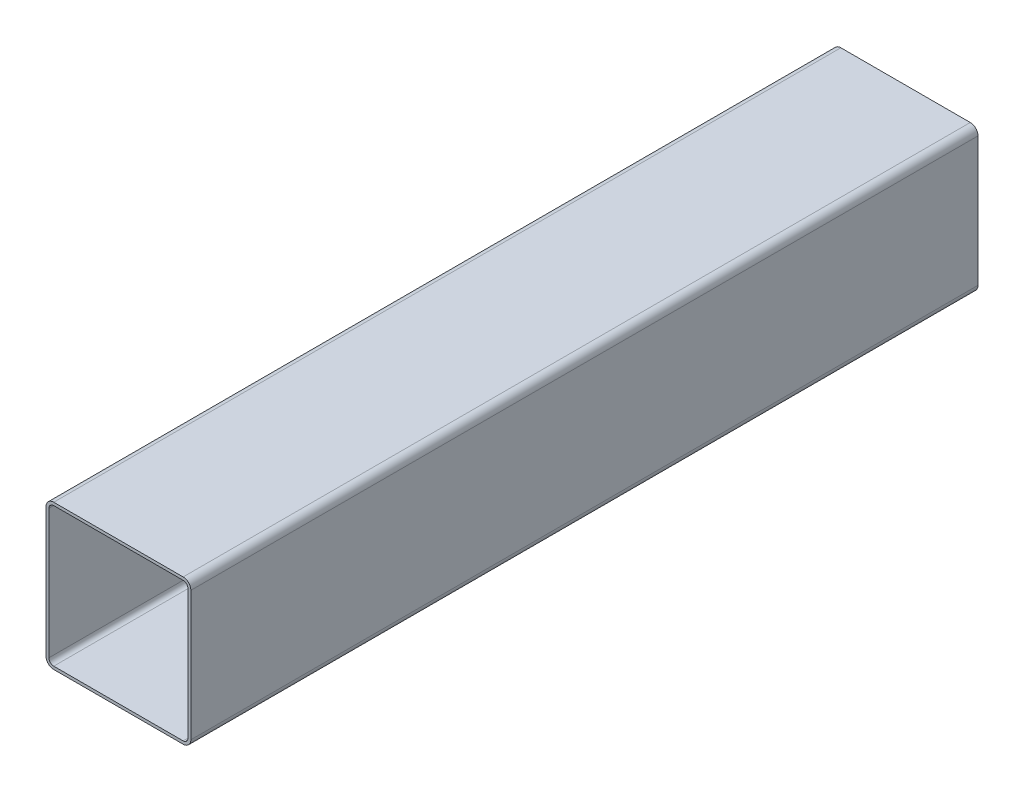
ISO-10303-21;
HEADER;
FILE_DESCRIPTION(('STEP AP214'),'2;1');
FILE_NAME('part.step','',(''),(''),'','','');
FILE_SCHEMA(('AUTOMOTIVE_DESIGN { 1 0 10303 214 1 1 1 1 }'));
ENDSEC;
DATA;
#1=APPLICATION_CONTEXT('core data for automotive mechanical design processes');
#2=APPLICATION_PROTOCOL_DEFINITION('international standard','automotive_design',2000,#1);
#3=PRODUCT_CONTEXT('',#1,'mechanical');
#4=PRODUCT('Part','Part','',(#3));
#5=PRODUCT_RELATED_PRODUCT_CATEGORY('part','',(#4));
#6=PRODUCT_DEFINITION_FORMATION('','',#4);
#7=PRODUCT_DEFINITION_CONTEXT('part definition',#1,'design');
#8=PRODUCT_DEFINITION('design','',#6,#7);
#9=PRODUCT_DEFINITION_SHAPE('','',#8);
#10=(LENGTH_UNIT() NAMED_UNIT(*) SI_UNIT(.MILLI.,.METRE.));
#11=(NAMED_UNIT(*) PLANE_ANGLE_UNIT() SI_UNIT($,.RADIAN.));
#12=(NAMED_UNIT(*) SI_UNIT($,.STERADIAN.) SOLID_ANGLE_UNIT());
#13=UNCERTAINTY_MEASURE_WITH_UNIT(LENGTH_MEASURE(1.E-05),#10,'distance_accuracy_value','');
#14=(GEOMETRIC_REPRESENTATION_CONTEXT(3) GLOBAL_UNCERTAINTY_ASSIGNED_CONTEXT((#13)) GLOBAL_UNIT_ASSIGNED_CONTEXT((#10,
#11,#12)) REPRESENTATION_CONTEXT('',''));
#15=CARTESIAN_POINT('',(0.,0.,0.));
#16=DIRECTION('',(0.,0.,1.));
#17=DIRECTION('',(1.,0.,0.));
#18=AXIS2_PLACEMENT_3D('',#15,#16,#17);
#19=CARTESIAN_POINT('',(-67.,-67.,815.));
#20=DIRECTION('',(0.,0.,1.));
#21=DIRECTION('',(1.,0.,0.));
#22=AXIS2_PLACEMENT_3D('',#19,#20,#21);
#23=PLANE('',#22);
#24=CARTESIAN_POINT('',(-67.,-67.,815.));
#25=DIRECTION('',(0.,0.,1.));
#26=DIRECTION('',(1.,0.,0.));
#27=AXIS2_PLACEMENT_3D('',#24,#25,#26);
#28=CIRCLE('',#27,7.99999999999999);
#29=CARTESIAN_POINT('',(-75.,-66.9999999999999,815.));
#30=VERTEX_POINT('',#29);
#31=CARTESIAN_POINT('',(-66.9999999999999,-75.,815.));
#32=VERTEX_POINT('',#31);
#33=EDGE_CURVE('E263',#30,#32,#28,.T.);
#34=ORIENTED_EDGE('',*,*,#33,.T.);
#35=DIRECTION('',(1.,0.,0.));
#36=VECTOR('',#35,1.);
#37=CARTESIAN_POINT('',(66.9999999999999,-75.,815.));
#38=LINE('',#37,#36);
#39=CARTESIAN_POINT('',(66.9999999999999,-75.,815.));
#40=VERTEX_POINT('',#39);
#41=EDGE_CURVE('E266',#32,#40,#38,.T.);
#42=ORIENTED_EDGE('',*,*,#41,.T.);
#43=CARTESIAN_POINT('',(67.,-67.,815.));
#44=DIRECTION('',(0.,0.,1.));
#45=DIRECTION('',(1.,0.,0.));
#46=AXIS2_PLACEMENT_3D('',#43,#44,#45);
#47=CIRCLE('',#46,7.99999999999999);
#48=CARTESIAN_POINT('',(75.,-66.9999999999999,815.));
#49=VERTEX_POINT('',#48);
#50=EDGE_CURVE('E269',#40,#49,#47,.T.);
#51=ORIENTED_EDGE('',*,*,#50,.T.);
#52=DIRECTION('',(0.,1.,0.));
#53=VECTOR('',#52,1.);
#54=CARTESIAN_POINT('',(75.,-66.9999999999999,815.));
#55=LINE('',#54,#53);
#56=CARTESIAN_POINT('',(75.,66.9999999999999,815.));
#57=VERTEX_POINT('',#56);
#58=EDGE_CURVE('E271',#49,#57,#55,.T.);
#59=ORIENTED_EDGE('',*,*,#58,.T.);
#60=CARTESIAN_POINT('',(67.,67.,815.));
#61=DIRECTION('',(0.,0.,1.));
#62=DIRECTION('',(1.,0.,0.));
#63=AXIS2_PLACEMENT_3D('',#60,#61,#62);
#64=CIRCLE('',#63,7.99999999999999);
#65=CARTESIAN_POINT('',(66.9999999999999,75.,815.));
#66=VERTEX_POINT('',#65);
#67=EDGE_CURVE('E273',#57,#66,#64,.T.);
#68=ORIENTED_EDGE('',*,*,#67,.T.);
#69=DIRECTION('',(-1.,0.,0.));
#70=VECTOR('',#69,1.);
#71=CARTESIAN_POINT('',(66.9999999999999,75.,815.));
#72=LINE('',#71,#70);
#73=CARTESIAN_POINT('',(-66.9999999999999,75.,815.));
#74=VERTEX_POINT('',#73);
#75=EDGE_CURVE('E275',#66,#74,#72,.T.);
#76=ORIENTED_EDGE('',*,*,#75,.T.);
#77=CARTESIAN_POINT('',(-67.,67.,815.));
#78=DIRECTION('',(0.,0.,1.));
#79=DIRECTION('',(-1.,0.,0.));
#80=AXIS2_PLACEMENT_3D('',#77,#78,#79);
#81=CIRCLE('',#80,7.99999999999999);
#82=CARTESIAN_POINT('',(-75.,66.9999999999999,815.));
#83=VERTEX_POINT('',#82);
#84=EDGE_CURVE('E277',#74,#83,#81,.T.);
#85=ORIENTED_EDGE('',*,*,#84,.T.);
#86=DIRECTION('',(0.,-1.,0.));
#87=VECTOR('',#86,1.);
#88=CARTESIAN_POINT('',(-75.,-66.9999999999999,815.));
#89=LINE('',#88,#87);
#90=EDGE_CURVE('E279',#83,#30,#89,.T.);
#91=ORIENTED_EDGE('',*,*,#90,.T.);
#92=EDGE_LOOP('',(#34,#42,#51,#59,#68,#76,#85,#91));
#93=FACE_BOUND('',#92,.T.);
#94=DIRECTION('',(1.,0.,0.));
#95=VECTOR('',#94,1.);
#96=CARTESIAN_POINT('',(66.9999999999999,-72.,815.));
#97=LINE('',#96,#95);
#98=CARTESIAN_POINT('',(-66.9999999999999,-72.,815.));
#99=VERTEX_POINT('',#98);
#100=CARTESIAN_POINT('',(66.9999999999999,-72.,815.));
#101=VERTEX_POINT('',#100);
#102=EDGE_CURVE('E206',#99,#101,#97,.T.);
#103=ORIENTED_EDGE('',*,*,#102,.F.);
#104=CARTESIAN_POINT('',(-67.,-67.,815.));
#105=DIRECTION('',(0.,0.,1.));
#106=DIRECTION('',(1.,0.,0.));
#107=AXIS2_PLACEMENT_3D('',#104,#105,#106);
#108=CIRCLE('',#107,4.99999999999999);
#109=CARTESIAN_POINT('',(-72.,-66.9999999999999,815.));
#110=VERTEX_POINT('',#109);
#111=EDGE_CURVE('E198',#110,#99,#108,.T.);
#112=ORIENTED_EDGE('',*,*,#111,.F.);
#113=DIRECTION('',(0.,-1.,0.));
#114=VECTOR('',#113,1.);
#115=CARTESIAN_POINT('',(-72.,-66.9999999999999,815.));
#116=LINE('',#115,#114);
#117=CARTESIAN_POINT('',(-72.,67.,815.));
#118=VERTEX_POINT('',#117);
#119=EDGE_CURVE('E231',#118,#110,#116,.T.);
#120=ORIENTED_EDGE('',*,*,#119,.F.);
#121=CARTESIAN_POINT('',(-67.,67.,815.));
#122=DIRECTION('',(0.,0.,1.));
#123=DIRECTION('',(1.,0.,0.));
#124=AXIS2_PLACEMENT_3D('',#121,#122,#123);
#125=CIRCLE('',#124,4.99999999999999);
#126=CARTESIAN_POINT('',(-67.,72.,815.));
#127=VERTEX_POINT('',#126);
#128=EDGE_CURVE('E229',#127,#118,#125,.T.);
#129=ORIENTED_EDGE('',*,*,#128,.F.);
#130=DIRECTION('',(-1.,0.,0.));
#131=VECTOR('',#130,1.);
#132=CARTESIAN_POINT('',(66.9999999999999,72.,815.));
#133=LINE('',#132,#131);
#134=CARTESIAN_POINT('',(67.,72.,815.));
#135=VERTEX_POINT('',#134);
#136=EDGE_CURVE('E227',#135,#127,#133,.T.);
#137=ORIENTED_EDGE('',*,*,#136,.F.);
#138=CARTESIAN_POINT('',(67.,67.,815.));
#139=DIRECTION('',(0.,0.,1.));
#140=DIRECTION('',(1.,0.,0.));
#141=AXIS2_PLACEMENT_3D('',#138,#139,#140);
#142=CIRCLE('',#141,4.99999999999999);
#143=CARTESIAN_POINT('',(72.,66.9999999999999,815.));
#144=VERTEX_POINT('',#143);
#145=EDGE_CURVE('E225',#144,#135,#142,.T.);
#146=ORIENTED_EDGE('',*,*,#145,.F.);
#147=DIRECTION('',(0.,1.,0.));
#148=VECTOR('',#147,1.);
#149=CARTESIAN_POINT('',(72.,-66.9999999999999,815.));
#150=LINE('',#149,#148);
#151=CARTESIAN_POINT('',(72.,-67.,815.));
#152=VERTEX_POINT('',#151);
#153=EDGE_CURVE('E221',#152,#144,#150,.T.);
#154=ORIENTED_EDGE('',*,*,#153,.F.);
#155=CARTESIAN_POINT('',(67.,-67.,815.));
#156=DIRECTION('',(0.,0.,1.));
#157=DIRECTION('',(1.,0.,0.));
#158=AXIS2_PLACEMENT_3D('',#155,#156,#157);
#159=CIRCLE('',#158,4.99999999999999);
#160=EDGE_CURVE('E219',#101,#152,#159,.T.);
#161=ORIENTED_EDGE('',*,*,#160,.F.);
#162=EDGE_LOOP('',(#103,#112,#120,#129,#137,#146,#154,#161));
#163=FACE_BOUND('',#162,.T.);
#164=ADVANCED_FACE('F85',(#93,#163),#23,.T.);
#165=CARTESIAN_POINT('',(-67.,-67.,0.));
#166=DIRECTION('',(0.,0.,1.));
#167=DIRECTION('',(1.,0.,0.));
#168=AXIS2_PLACEMENT_3D('',#165,#166,#167);
#169=PLANE('',#168);
#170=CARTESIAN_POINT('',(-67.,-67.,0.));
#171=DIRECTION('',(0.,0.,1.));
#172=DIRECTION('',(1.,0.,0.));
#173=AXIS2_PLACEMENT_3D('',#170,#171,#172);
#174=CIRCLE('',#173,7.99999999999999);
#175=CARTESIAN_POINT('',(-75.,-66.9999999999999,0.));
#176=VERTEX_POINT('',#175);
#177=CARTESIAN_POINT('',(-66.9999999999999,-75.,0.));
#178=VERTEX_POINT('',#177);
#179=EDGE_CURVE('E214',#176,#178,#174,.T.);
#180=ORIENTED_EDGE('',*,*,#179,.F.);
#181=DIRECTION('',(0.,-1.,0.));
#182=VECTOR('',#181,1.);
#183=CARTESIAN_POINT('',(-75.,-66.9999999999999,0.));
#184=LINE('',#183,#182);
#185=CARTESIAN_POINT('',(-75.,66.9999999999999,0.));
#186=VERTEX_POINT('',#185);
#187=EDGE_CURVE('E267',#186,#176,#184,.T.);
#188=ORIENTED_EDGE('',*,*,#187,.F.);
#189=CARTESIAN_POINT('',(-67.,67.,0.));
#190=DIRECTION('',(0.,0.,1.));
#191=DIRECTION('',(-1.,0.,0.));
#192=AXIS2_PLACEMENT_3D('',#189,#190,#191);
#193=CIRCLE('',#192,7.99999999999999);
#194=CARTESIAN_POINT('',(-66.9999999999999,75.,0.));
#195=VERTEX_POINT('',#194);
#196=EDGE_CURVE('E294',#195,#186,#193,.T.);
#197=ORIENTED_EDGE('',*,*,#196,.F.);
#198=DIRECTION('',(-1.,0.,0.));
#199=VECTOR('',#198,1.);
#200=CARTESIAN_POINT('',(66.9999999999999,75.,0.));
#201=LINE('',#200,#199);
#202=CARTESIAN_POINT('',(66.9999999999999,75.,0.));
#203=VERTEX_POINT('',#202);
#204=EDGE_CURVE('E292',#203,#195,#201,.T.);
#205=ORIENTED_EDGE('',*,*,#204,.F.);
#206=CARTESIAN_POINT('',(67.,67.,0.));
#207=DIRECTION('',(0.,0.,1.));
#208=DIRECTION('',(1.,0.,0.));
#209=AXIS2_PLACEMENT_3D('',#206,#207,#208);
#210=CIRCLE('',#209,7.99999999999999);
#211=CARTESIAN_POINT('',(75.,66.9999999999999,0.));
#212=VERTEX_POINT('',#211);
#213=EDGE_CURVE('E290',#212,#203,#210,.T.);
#214=ORIENTED_EDGE('',*,*,#213,.F.);
#215=DIRECTION('',(0.,1.,0.));
#216=VECTOR('',#215,1.);
#217=CARTESIAN_POINT('',(75.,-66.9999999999999,0.));
#218=LINE('',#217,#216);
#219=CARTESIAN_POINT('',(75.,-66.9999999999999,0.));
#220=VERTEX_POINT('',#219);
#221=EDGE_CURVE('E288',#220,#212,#218,.T.);
#222=ORIENTED_EDGE('',*,*,#221,.F.);
#223=CARTESIAN_POINT('',(67.,-67.,0.));
#224=DIRECTION('',(0.,0.,1.));
#225=DIRECTION('',(1.,0.,0.));
#226=AXIS2_PLACEMENT_3D('',#223,#224,#225);
#227=CIRCLE('',#226,7.99999999999999);
#228=CARTESIAN_POINT('',(66.9999999999999,-75.,0.));
#229=VERTEX_POINT('',#228);
#230=EDGE_CURVE('E286',#229,#220,#227,.T.);
#231=ORIENTED_EDGE('',*,*,#230,.F.);
#232=DIRECTION('',(1.,0.,0.));
#233=VECTOR('',#232,1.);
#234=CARTESIAN_POINT('',(66.9999999999999,-75.,0.));
#235=LINE('',#234,#233);
#236=EDGE_CURVE('E284',#178,#229,#235,.T.);
#237=ORIENTED_EDGE('',*,*,#236,.F.);
#238=EDGE_LOOP('',(#180,#188,#197,#205,#214,#222,#231,#237));
#239=FACE_BOUND('',#238,.T.);
#240=CARTESIAN_POINT('',(-67.,-67.,0.));
#241=DIRECTION('',(0.,0.,1.));
#242=DIRECTION('',(1.,0.,0.));
#243=AXIS2_PLACEMENT_3D('',#240,#241,#242);
#244=CIRCLE('',#243,4.99999999999999);
#245=CARTESIAN_POINT('',(-72.,-66.9999999999999,0.));
#246=VERTEX_POINT('',#245);
#247=CARTESIAN_POINT('',(-66.9999999999999,-72.,0.));
#248=VERTEX_POINT('',#247);
#249=EDGE_CURVE('E108',#246,#248,#244,.T.);
#250=ORIENTED_EDGE('',*,*,#249,.T.);
#251=DIRECTION('',(1.,0.,0.));
#252=VECTOR('',#251,1.);
#253=CARTESIAN_POINT('',(66.9999999999999,-72.,0.));
#254=LINE('',#253,#252);
#255=CARTESIAN_POINT('',(66.9999999999999,-72.,0.));
#256=VERTEX_POINT('',#255);
#257=EDGE_CURVE('E213',#248,#256,#254,.T.);
#258=ORIENTED_EDGE('',*,*,#257,.T.);
#259=CARTESIAN_POINT('',(67.,-67.,0.));
#260=DIRECTION('',(0.,0.,1.));
#261=DIRECTION('',(1.,0.,0.));
#262=AXIS2_PLACEMENT_3D('',#259,#260,#261);
#263=CIRCLE('',#262,4.99999999999999);
#264=CARTESIAN_POINT('',(72.,-67.,0.));
#265=VERTEX_POINT('',#264);
#266=EDGE_CURVE('E235',#256,#265,#263,.T.);
#267=ORIENTED_EDGE('',*,*,#266,.T.);
#268=DIRECTION('',(0.,1.,0.));
#269=VECTOR('',#268,1.);
#270=CARTESIAN_POINT('',(72.,-66.9999999999999,0.));
#271=LINE('',#270,#269);
#272=CARTESIAN_POINT('',(72.,66.9999999999999,0.));
#273=VERTEX_POINT('',#272);
#274=EDGE_CURVE('E238',#265,#273,#271,.T.);
#275=ORIENTED_EDGE('',*,*,#274,.T.);
#276=CARTESIAN_POINT('',(67.,67.,0.));
#277=DIRECTION('',(0.,0.,1.));
#278=DIRECTION('',(1.,0.,0.));
#279=AXIS2_PLACEMENT_3D('',#276,#277,#278);
#280=CIRCLE('',#279,4.99999999999999);
#281=CARTESIAN_POINT('',(67.,72.,0.));
#282=VERTEX_POINT('',#281);
#283=EDGE_CURVE('E241',#273,#282,#280,.T.);
#284=ORIENTED_EDGE('',*,*,#283,.T.);
#285=DIRECTION('',(-1.,0.,0.));
#286=VECTOR('',#285,1.);
#287=CARTESIAN_POINT('',(66.9999999999999,72.,0.));
#288=LINE('',#287,#286);
#289=CARTESIAN_POINT('',(-67.,72.,0.));
#290=VERTEX_POINT('',#289);
#291=EDGE_CURVE('E244',#282,#290,#288,.T.);
#292=ORIENTED_EDGE('',*,*,#291,.T.);
#293=CARTESIAN_POINT('',(-67.,67.,0.));
#294=DIRECTION('',(0.,0.,1.));
#295=DIRECTION('',(1.,0.,0.));
#296=AXIS2_PLACEMENT_3D('',#293,#294,#295);
#297=CIRCLE('',#296,4.99999999999999);
#298=CARTESIAN_POINT('',(-72.,66.9999999999999,0.));
#299=VERTEX_POINT('',#298);
#300=EDGE_CURVE('E247',#290,#299,#297,.T.);
#301=ORIENTED_EDGE('',*,*,#300,.T.);
#302=DIRECTION('',(0.,-1.,0.));
#303=VECTOR('',#302,1.);
#304=CARTESIAN_POINT('',(-72.,-66.9999999999999,0.));
#305=LINE('',#304,#303);
#306=EDGE_CURVE('E207',#299,#246,#305,.T.);
#307=ORIENTED_EDGE('',*,*,#306,.T.);
#308=EDGE_LOOP('',(#250,#258,#267,#275,#284,#292,#301,#307));
#309=FACE_BOUND('',#308,.T.);
#310=ADVANCED_FACE('F324',(#239,#309),#169,.F.);
#311=CARTESIAN_POINT('',(-67.,-67.,815.));
#312=DIRECTION('',(0.,0.,-1.));
#313=DIRECTION('',(-1.,0.,0.));
#314=AXIS2_PLACEMENT_3D('',#311,#312,#313);
#315=CYLINDRICAL_SURFACE('',#314,7.99999999999999);
#316=ORIENTED_EDGE('',*,*,#179,.T.);
#317=DIRECTION('',(0.,0.,-1.));
#318=VECTOR('',#317,1.);
#319=CARTESIAN_POINT('',(-66.9999999999999,-75.,815.));
#320=LINE('',#319,#318);
#321=EDGE_CURVE('E12',#32,#178,#320,.T.);
#322=ORIENTED_EDGE('',*,*,#321,.F.);
#323=ORIENTED_EDGE('',*,*,#33,.F.);
#324=DIRECTION('',(0.,0.,-1.));
#325=VECTOR('',#324,1.);
#326=CARTESIAN_POINT('',(-75.,-66.9999999999999,815.));
#327=LINE('',#326,#325);
#328=EDGE_CURVE('E281',#30,#176,#327,.T.);
#329=ORIENTED_EDGE('',*,*,#328,.T.);
#330=EDGE_LOOP('',(#316,#322,#323,#329));
#331=FACE_BOUND('',#330,.T.);
#332=ADVANCED_FACE('F87',(#331),#315,.T.);
#333=CARTESIAN_POINT('',(66.9999999999999,-75.,815.));
#334=DIRECTION('',(0.,1.,0.));
#335=DIRECTION('',(-1.,0.,0.));
#336=AXIS2_PLACEMENT_3D('',#333,#334,#335);
#337=PLANE('',#336);
#338=ORIENTED_EDGE('',*,*,#236,.T.);
#339=DIRECTION('',(0.,0.,-1.));
#340=VECTOR('',#339,1.);
#341=CARTESIAN_POINT('',(66.9999999999999,-75.,815.));
#342=LINE('',#341,#340);
#343=EDGE_CURVE('E93',#40,#229,#342,.T.);
#344=ORIENTED_EDGE('',*,*,#343,.F.);
#345=ORIENTED_EDGE('',*,*,#41,.F.);
#346=ORIENTED_EDGE('',*,*,#321,.T.);
#347=EDGE_LOOP('',(#338,#344,#345,#346));
#348=FACE_BOUND('',#347,.T.);
#349=ADVANCED_FACE('F341',(#348),#337,.F.);
#350=CARTESIAN_POINT('',(67.,-67.,815.));
#351=DIRECTION('',(0.,0.,-1.));
#352=DIRECTION('',(-1.,0.,0.));
#353=AXIS2_PLACEMENT_3D('',#350,#351,#352);
#354=CYLINDRICAL_SURFACE('',#353,7.99999999999999);
#355=ORIENTED_EDGE('',*,*,#230,.T.);
#356=DIRECTION('',(0.,0.,-1.));
#357=VECTOR('',#356,1.);
#358=CARTESIAN_POINT('',(75.,-66.9999999999999,815.));
#359=LINE('',#358,#357);
#360=EDGE_CURVE('E311',#49,#220,#359,.T.);
#361=ORIENTED_EDGE('',*,*,#360,.F.);
#362=ORIENTED_EDGE('',*,*,#50,.F.);
#363=ORIENTED_EDGE('',*,*,#343,.T.);
#364=EDGE_LOOP('',(#355,#361,#362,#363));
#365=FACE_BOUND('',#364,.T.);
#366=ADVANCED_FACE('F318',(#365),#354,.T.);
#367=CARTESIAN_POINT('',(75.,-66.9999999999999,815.));
#368=DIRECTION('',(-1.,0.,0.));
#369=DIRECTION('',(0.,0.,1.));
#370=AXIS2_PLACEMENT_3D('',#367,#368,#369);
#371=PLANE('',#370);
#372=ORIENTED_EDGE('',*,*,#221,.T.);
#373=DIRECTION('',(0.,0.,-1.));
#374=VECTOR('',#373,1.);
#375=CARTESIAN_POINT('',(75.,66.9999999999999,815.));
#376=LINE('',#375,#374);
#377=EDGE_CURVE('E308',#57,#212,#376,.T.);
#378=ORIENTED_EDGE('',*,*,#377,.F.);
#379=ORIENTED_EDGE('',*,*,#58,.F.);
#380=ORIENTED_EDGE('',*,*,#360,.T.);
#381=EDGE_LOOP('',(#372,#378,#379,#380));
#382=FACE_BOUND('',#381,.T.);
#383=ADVANCED_FACE('F330',(#382),#371,.F.);
#384=CARTESIAN_POINT('',(67.,67.,815.));
#385=DIRECTION('',(0.,0.,-1.));
#386=DIRECTION('',(-1.,0.,0.));
#387=AXIS2_PLACEMENT_3D('',#384,#385,#386);
#388=CYLINDRICAL_SURFACE('',#387,7.99999999999999);
#389=ORIENTED_EDGE('',*,*,#213,.T.);
#390=DIRECTION('',(0.,0.,-1.));
#391=VECTOR('',#390,1.);
#392=CARTESIAN_POINT('',(66.9999999999999,75.,815.));
#393=LINE('',#392,#391);
#394=EDGE_CURVE('E305',#66,#203,#393,.T.);
#395=ORIENTED_EDGE('',*,*,#394,.F.);
#396=ORIENTED_EDGE('',*,*,#67,.F.);
#397=ORIENTED_EDGE('',*,*,#377,.T.);
#398=EDGE_LOOP('',(#389,#395,#396,#397));
#399=FACE_BOUND('',#398,.T.);
#400=ADVANCED_FACE('F334',(#399),#388,.T.);
#401=CARTESIAN_POINT('',(66.9999999999999,75.,815.));
#402=DIRECTION('',(0.,-1.,0.));
#403=DIRECTION('',(1.,0.,0.));
#404=AXIS2_PLACEMENT_3D('',#401,#402,#403);
#405=PLANE('',#404);
#406=ORIENTED_EDGE('',*,*,#204,.T.);
#407=DIRECTION('',(0.,0.,-1.));
#408=VECTOR('',#407,1.);
#409=CARTESIAN_POINT('',(-66.9999999999999,75.,815.));
#410=LINE('',#409,#408);
#411=EDGE_CURVE('E302',#74,#195,#410,.T.);
#412=ORIENTED_EDGE('',*,*,#411,.F.);
#413=ORIENTED_EDGE('',*,*,#75,.F.);
#414=ORIENTED_EDGE('',*,*,#394,.T.);
#415=EDGE_LOOP('',(#406,#412,#413,#414));
#416=FACE_BOUND('',#415,.T.);
#417=ADVANCED_FACE('F354',(#416),#405,.F.);
#418=CARTESIAN_POINT('',(-67.,67.,815.));
#419=DIRECTION('',(0.,0.,-1.));
#420=DIRECTION('',(-1.,0.,0.));
#421=AXIS2_PLACEMENT_3D('',#418,#419,#420);
#422=CYLINDRICAL_SURFACE('',#421,7.99999999999999);
#423=ORIENTED_EDGE('',*,*,#196,.T.);
#424=DIRECTION('',(0.,0.,-1.));
#425=VECTOR('',#424,1.);
#426=CARTESIAN_POINT('',(-75.,66.9999999999999,815.));
#427=LINE('',#426,#425);
#428=EDGE_CURVE('E299',#83,#186,#427,.T.);
#429=ORIENTED_EDGE('',*,*,#428,.F.);
#430=ORIENTED_EDGE('',*,*,#84,.F.);
#431=ORIENTED_EDGE('',*,*,#411,.T.);
#432=EDGE_LOOP('',(#423,#429,#430,#431));
#433=FACE_BOUND('',#432,.T.);
#434=ADVANCED_FACE('F352',(#433),#422,.T.);
#435=CARTESIAN_POINT('',(-75.,-66.9999999999999,815.));
#436=DIRECTION('',(1.,0.,0.));
#437=DIRECTION('',(0.,0.,-1.));
#438=AXIS2_PLACEMENT_3D('',#435,#436,#437);
#439=PLANE('',#438);
#440=ORIENTED_EDGE('',*,*,#187,.T.);
#441=ORIENTED_EDGE('',*,*,#328,.F.);
#442=ORIENTED_EDGE('',*,*,#90,.F.);
#443=ORIENTED_EDGE('',*,*,#428,.T.);
#444=EDGE_LOOP('',(#440,#441,#442,#443));
#445=FACE_BOUND('',#444,.T.);
#446=ADVANCED_FACE('F347',(#445),#439,.F.);
#447=CARTESIAN_POINT('',(-67.,-67.,815.));
#448=DIRECTION('',(0.,0.,-1.));
#449=DIRECTION('',(-1.,0.,0.));
#450=AXIS2_PLACEMENT_3D('',#447,#448,#449);
#451=CYLINDRICAL_SURFACE('',#450,4.99999999999999);
#452=ORIENTED_EDGE('',*,*,#249,.F.);
#453=DIRECTION('',(0.,0.,-1.));
#454=VECTOR('',#453,1.);
#455=CARTESIAN_POINT('',(-72.,-66.9999999999999,815.));
#456=LINE('',#455,#454);
#457=EDGE_CURVE('E202',#110,#246,#456,.T.);
#458=ORIENTED_EDGE('',*,*,#457,.F.);
#459=ORIENTED_EDGE('',*,*,#111,.T.);
#460=DIRECTION('',(0.,0.,-1.));
#461=VECTOR('',#460,1.);
#462=CARTESIAN_POINT('',(-66.9999999999999,-72.,815.));
#463=LINE('',#462,#461);
#464=EDGE_CURVE('E201',#99,#248,#463,.T.);
#465=ORIENTED_EDGE('',*,*,#464,.T.);
#466=EDGE_LOOP('',(#452,#458,#459,#465));
#467=FACE_BOUND('',#466,.T.);
#468=ADVANCED_FACE('F200',(#467),#451,.F.);
#469=CARTESIAN_POINT('',(66.9999999999999,-72.,815.));
#470=DIRECTION('',(0.,1.,0.));
#471=DIRECTION('',(-1.,0.,0.));
#472=AXIS2_PLACEMENT_3D('',#469,#470,#471);
#473=PLANE('',#472);
#474=ORIENTED_EDGE('',*,*,#257,.F.);
#475=ORIENTED_EDGE('',*,*,#464,.F.);
#476=ORIENTED_EDGE('',*,*,#102,.T.);
#477=DIRECTION('',(0.,0.,-1.));
#478=VECTOR('',#477,1.);
#479=CARTESIAN_POINT('',(66.9999999999999,-72.,815.));
#480=LINE('',#479,#478);
#481=EDGE_CURVE('E215',#101,#256,#480,.T.);
#482=ORIENTED_EDGE('',*,*,#481,.T.);
#483=EDGE_LOOP('',(#474,#475,#476,#482));
#484=FACE_BOUND('',#483,.T.);
#485=ADVANCED_FACE('F210',(#484),#473,.T.);
#486=CARTESIAN_POINT('',(67.,-67.,815.));
#487=DIRECTION('',(0.,0.,-1.));
#488=DIRECTION('',(-1.,0.,0.));
#489=AXIS2_PLACEMENT_3D('',#486,#487,#488);
#490=CYLINDRICAL_SURFACE('',#489,4.99999999999999);
#491=ORIENTED_EDGE('',*,*,#266,.F.);
#492=ORIENTED_EDGE('',*,*,#481,.F.);
#493=ORIENTED_EDGE('',*,*,#160,.T.);
#494=DIRECTION('',(0.,0.,-1.));
#495=VECTOR('',#494,1.);
#496=CARTESIAN_POINT('',(72.,-67.,815.));
#497=LINE('',#496,#495);
#498=EDGE_CURVE('E260',#152,#265,#497,.T.);
#499=ORIENTED_EDGE('',*,*,#498,.T.);
#500=EDGE_LOOP('',(#491,#492,#493,#499));
#501=FACE_BOUND('',#500,.T.);
#502=ADVANCED_FACE('F379',(#501),#490,.F.);
#503=CARTESIAN_POINT('',(72.,-66.9999999999999,815.));
#504=DIRECTION('',(-1.,0.,0.));
#505=DIRECTION('',(0.,0.,1.));
#506=AXIS2_PLACEMENT_3D('',#503,#504,#505);
#507=PLANE('',#506);
#508=ORIENTED_EDGE('',*,*,#274,.F.);
#509=ORIENTED_EDGE('',*,*,#498,.F.);
#510=ORIENTED_EDGE('',*,*,#153,.T.);
#511=DIRECTION('',(0.,0.,-1.));
#512=VECTOR('',#511,1.);
#513=CARTESIAN_POINT('',(72.,66.9999999999999,815.));
#514=LINE('',#513,#512);
#515=EDGE_CURVE('E258',#144,#273,#514,.T.);
#516=ORIENTED_EDGE('',*,*,#515,.T.);
#517=EDGE_LOOP('',(#508,#509,#510,#516));
#518=FACE_BOUND('',#517,.T.);
#519=ADVANCED_FACE('F383',(#518),#507,.T.);
#520=CARTESIAN_POINT('',(67.,67.,815.));
#521=DIRECTION('',(0.,0.,-1.));
#522=DIRECTION('',(-1.,0.,0.));
#523=AXIS2_PLACEMENT_3D('',#520,#521,#522);
#524=CYLINDRICAL_SURFACE('',#523,4.99999999999999);
#525=ORIENTED_EDGE('',*,*,#283,.F.);
#526=ORIENTED_EDGE('',*,*,#515,.F.);
#527=ORIENTED_EDGE('',*,*,#145,.T.);
#528=DIRECTION('',(0.,0.,-1.));
#529=VECTOR('',#528,1.);
#530=CARTESIAN_POINT('',(67.,72.,815.));
#531=LINE('',#530,#529);
#532=EDGE_CURVE('E256',#135,#282,#531,.T.);
#533=ORIENTED_EDGE('',*,*,#532,.T.);
#534=EDGE_LOOP('',(#525,#526,#527,#533));
#535=FACE_BOUND('',#534,.T.);
#536=ADVANCED_FACE('F389',(#535),#524,.F.);
#537=CARTESIAN_POINT('',(66.9999999999999,72.,815.));
#538=DIRECTION('',(0.,-1.,0.));
#539=DIRECTION('',(1.,0.,0.));
#540=AXIS2_PLACEMENT_3D('',#537,#538,#539);
#541=PLANE('',#540);
#542=ORIENTED_EDGE('',*,*,#291,.F.);
#543=ORIENTED_EDGE('',*,*,#532,.F.);
#544=ORIENTED_EDGE('',*,*,#136,.T.);
#545=DIRECTION('',(0.,0.,-1.));
#546=VECTOR('',#545,1.);
#547=CARTESIAN_POINT('',(-67.,72.,815.));
#548=LINE('',#547,#546);
#549=EDGE_CURVE('E254',#127,#290,#548,.T.);
#550=ORIENTED_EDGE('',*,*,#549,.T.);
#551=EDGE_LOOP('',(#542,#543,#544,#550));
#552=FACE_BOUND('',#551,.T.);
#553=ADVANCED_FACE('F393',(#552),#541,.T.);
#554=CARTESIAN_POINT('',(-67.,67.,815.));
#555=DIRECTION('',(0.,0.,-1.));
#556=DIRECTION('',(-1.,0.,0.));
#557=AXIS2_PLACEMENT_3D('',#554,#555,#556);
#558=CYLINDRICAL_SURFACE('',#557,4.99999999999999);
#559=ORIENTED_EDGE('',*,*,#300,.F.);
#560=ORIENTED_EDGE('',*,*,#549,.F.);
#561=ORIENTED_EDGE('',*,*,#128,.T.);
#562=DIRECTION('',(0.,0.,-1.));
#563=VECTOR('',#562,1.);
#564=CARTESIAN_POINT('',(-72.,66.9999999999999,815.));
#565=LINE('',#564,#563);
#566=EDGE_CURVE('E100',#118,#299,#565,.T.);
#567=ORIENTED_EDGE('',*,*,#566,.T.);
#568=EDGE_LOOP('',(#559,#560,#561,#567));
#569=FACE_BOUND('',#568,.T.);
#570=ADVANCED_FACE('F397',(#569),#558,.F.);
#571=CARTESIAN_POINT('',(-72.,-66.9999999999999,815.));
#572=DIRECTION('',(1.,0.,0.));
#573=DIRECTION('',(0.,0.,-1.));
#574=AXIS2_PLACEMENT_3D('',#571,#572,#573);
#575=PLANE('',#574);
#576=ORIENTED_EDGE('',*,*,#306,.F.);
#577=ORIENTED_EDGE('',*,*,#566,.F.);
#578=ORIENTED_EDGE('',*,*,#119,.T.);
#579=ORIENTED_EDGE('',*,*,#457,.T.);
#580=EDGE_LOOP('',(#576,#577,#578,#579));
#581=FACE_BOUND('',#580,.T.);
#582=ADVANCED_FACE('F401',(#581),#575,.T.);
#583=CLOSED_SHELL('',(#164,#310,#332,#349,#366,#383,#400,#417,#434,#446,#468,#485,#502,#519,
#536,#553,#570,#582));
#584=MANIFOLD_SOLID_BREP('B2',#583);
#585=ADVANCED_BREP_SHAPE_REPRESENTATION('',(#18,#584),#14);
#586=SHAPE_DEFINITION_REPRESENTATION(#9,#585);
ENDSEC;
END-ISO-10303-21;
